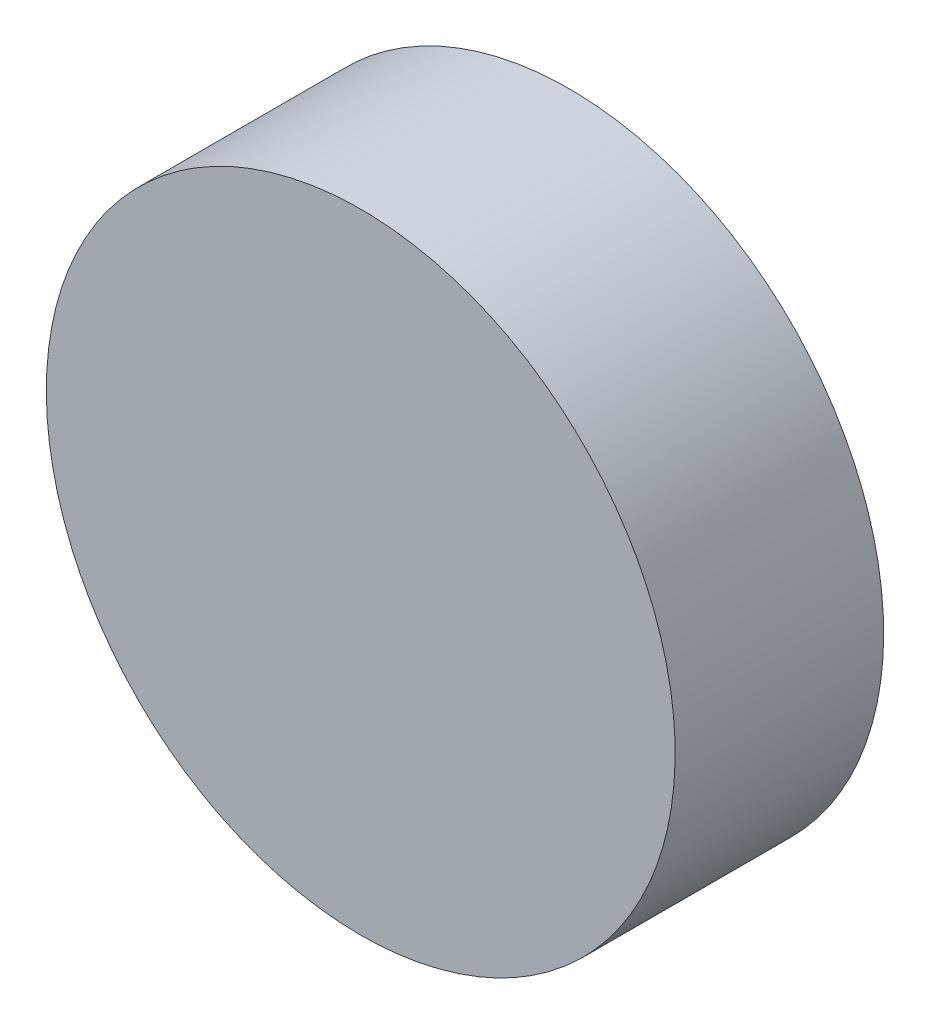
ISO-10303-21;
HEADER;
FILE_DESCRIPTION(('STEP AP214'),'2;1');
FILE_NAME('part.step','',(''),(''),'','','');
FILE_SCHEMA(('AUTOMOTIVE_DESIGN { 1 0 10303 214 1 1 1 1 }'));
ENDSEC;
DATA;
#1=APPLICATION_CONTEXT('core data for automotive mechanical design processes');
#2=APPLICATION_PROTOCOL_DEFINITION('international standard','automotive_design',2000,#1);
#3=PRODUCT_CONTEXT('',#1,'mechanical');
#4=PRODUCT('Part','Part','',(#3));
#5=PRODUCT_RELATED_PRODUCT_CATEGORY('part','',(#4));
#6=PRODUCT_DEFINITION_FORMATION('','',#4);
#7=PRODUCT_DEFINITION_CONTEXT('part definition',#1,'design');
#8=PRODUCT_DEFINITION('design','',#6,#7);
#9=PRODUCT_DEFINITION_SHAPE('','',#8);
#10=(LENGTH_UNIT() NAMED_UNIT(*) SI_UNIT(.MILLI.,.METRE.));
#11=(NAMED_UNIT(*) PLANE_ANGLE_UNIT() SI_UNIT($,.RADIAN.));
#12=(NAMED_UNIT(*) SI_UNIT($,.STERADIAN.) SOLID_ANGLE_UNIT());
#13=UNCERTAINTY_MEASURE_WITH_UNIT(LENGTH_MEASURE(1.E-05),#10,'distance_accuracy_value','');
#14=(GEOMETRIC_REPRESENTATION_CONTEXT(3) GLOBAL_UNCERTAINTY_ASSIGNED_CONTEXT((#13)) GLOBAL_UNIT_ASSIGNED_CONTEXT((#10,
#11,#12)) REPRESENTATION_CONTEXT('',''));
#15=CARTESIAN_POINT('',(0.,0.,0.));
#16=DIRECTION('',(0.,0.,1.));
#17=DIRECTION('',(1.,0.,0.));
#18=AXIS2_PLACEMENT_3D('',#15,#16,#17);
#19=CARTESIAN_POINT('',(3.01144784413701,66.8258666537316,123.808385168912));
#20=CARTESIAN_POINT('',(3.17967782334465,66.8258666537316,123.808385168912));
#21=CARTESIAN_POINT('',(3.51613778175993,66.8927927005884,123.808385168912));
#22=CARTESIAN_POINT('',(3.94399325140544,67.1786765855225,123.808385168912));
#23=CARTESIAN_POINT('',(4.2298771363395,67.606532055168,123.808385168912));
#24=CARTESIAN_POINT('',(4.33026620662476,68.1112219927909,123.808385168912));
#25=CARTESIAN_POINT('',(4.2298771363395,68.6159119304138,123.808385168912));
#26=CARTESIAN_POINT('',(3.94399325140544,69.0437674000594,123.808385168912));
#27=CARTESIAN_POINT('',(3.51613778175993,69.3296512849934,123.808385168912));
#28=CARTESIAN_POINT('',(3.01144784413701,69.4300403552787,123.808385168912));
#29=CARTESIAN_POINT('',(2.5067579065141,69.3296512849934,123.808385168912));
#30=CARTESIAN_POINT('',(2.07890243686859,69.0437674000594,123.808385168912));
#31=CARTESIAN_POINT('',(1.79301855193453,68.6159119304138,123.808385168912));
#32=CARTESIAN_POINT('',(1.69262948164926,68.1112219927909,123.808385168912));
#33=CARTESIAN_POINT('',(1.79301855193453,67.606532055168,123.808385168912));
#34=CARTESIAN_POINT('',(2.07890243686859,67.1786765855225,123.808385168912));
#35=CARTESIAN_POINT('',(2.5067579065141,66.8927927005885,123.808385168912));
#36=CARTESIAN_POINT('',(2.84321786492937,66.8258666537316,123.808385168912));
#37=CARTESIAN_POINT('',(3.01144784413701,66.8258666537316,123.808385168912));
#38=B_SPLINE_CURVE_WITH_KNOTS('',3,(#19,#20,#21,#22,#23,#24,#25,#26,#27,#28,#29,#30,#31,#32,#33,
#34,#35,#36,#37),.UNSPECIFIED.,.T.,.F.,(4,1,1,1,1,1,1,1,1,1,1,1,1,1,1,1,4),(0.,
0.0625000000000002,0.125,0.187499999999999,0.25,0.312500000000001,0.375,0.4375,0.5,0.5625,0.625,
0.687499999999999,0.75,0.812500000000001,0.875,0.9375,1.),.UNSPECIFIED.);
#39=DIRECTION('',(0.,0.,1.));
#40=VECTOR('',#39,1.);
#41=SURFACE_OF_LINEAR_EXTRUSION('',#38,#40);
#42=CARTESIAN_POINT('',(3.01144784413701,66.8258666537316,123.808385168912));
#43=CARTESIAN_POINT('',(3.17967782334465,66.8258666537316,123.808385168912));
#44=CARTESIAN_POINT('',(3.51613778175993,66.8927927005884,123.808385168912));
#45=CARTESIAN_POINT('',(3.94399325140544,67.1786765855225,123.808385168912));
#46=CARTESIAN_POINT('',(4.2298771363395,67.606532055168,123.808385168912));
#47=CARTESIAN_POINT('',(4.33026620662476,68.1112219927909,123.808385168912));
#48=CARTESIAN_POINT('',(4.2298771363395,68.6159119304138,123.808385168912));
#49=CARTESIAN_POINT('',(3.94399325140544,69.0437674000594,123.808385168912));
#50=CARTESIAN_POINT('',(3.51613778175993,69.3296512849934,123.808385168912));
#51=CARTESIAN_POINT('',(3.01144784413701,69.4300403552787,123.808385168912));
#52=CARTESIAN_POINT('',(2.5067579065141,69.3296512849934,123.808385168912));
#53=CARTESIAN_POINT('',(2.07890243686859,69.0437674000594,123.808385168912));
#54=CARTESIAN_POINT('',(1.79301855193453,68.6159119304138,123.808385168912));
#55=CARTESIAN_POINT('',(1.69262948164926,68.1112219927909,123.808385168912));
#56=CARTESIAN_POINT('',(1.79301855193453,67.606532055168,123.808385168912));
#57=CARTESIAN_POINT('',(2.07890243686859,67.1786765855225,123.808385168912));
#58=CARTESIAN_POINT('',(2.5067579065141,66.8927927005885,123.808385168912));
#59=CARTESIAN_POINT('',(2.84321786492937,66.8258666537316,123.808385168912));
#60=CARTESIAN_POINT('',(3.01144784413701,66.8258666537316,123.808385168912));
#61=B_SPLINE_CURVE_WITH_KNOTS('',3,(#42,#43,#44,#45,#46,#47,#48,#49,#50,#51,#52,#53,#54,#55,#56,
#57,#58,#59,#60),.UNSPECIFIED.,.T.,.F.,(4,1,1,1,1,1,1,1,1,1,1,1,1,1,1,1,4),(0.,
0.0625000000000002,0.125,0.187499999999999,0.25,0.312500000000001,0.375,0.4375,0.5,0.5625,0.625,
0.687499999999999,0.75,0.812500000000001,0.875,0.9375,1.),.UNSPECIFIED.);
#62=CARTESIAN_POINT('',(3.01144784413701,66.8258666537316,123.808385168912));
#63=VERTEX_POINT('',#62);
#64=EDGE_CURVE('E9',#63,#63,#61,.T.);
#65=ORIENTED_EDGE('',*,*,#64,.T.);
#66=EDGE_LOOP('',(#65));
#67=FACE_BOUND('',#66,.T.);
#68=CARTESIAN_POINT('',(3.01144784413701,66.8258666537316,124.660837467507));
#69=CARTESIAN_POINT('',(2.99041860054767,66.8258666385074,124.660837467507));
#70=CARTESIAN_POINT('',(2.96938979344613,66.8263895363258,124.660837467507));
#71=CARTESIAN_POINT('',(2.92738219718556,66.8284710407304,124.660837467507));
#72=CARTESIAN_POINT('',(2.90640341104201,66.8300297082485,124.660837467507));
#73=CARTESIAN_POINT('',(2.8645460516574,66.8341727745088,124.660837467507));
#74=CARTESIAN_POINT('',(2.84366748539274,66.8367572436396,124.660837467507));
#75=CARTESIAN_POINT('',(2.80206045823913,66.8429419710092,124.660837467507));
#76=CARTESIAN_POINT('',(2.78133200386357,66.8465422730576,124.660837467507));
#77=CARTESIAN_POINT('',(2.74007518295327,66.8547487643015,124.660837467507));
#78=CARTESIAN_POINT('',(2.71954681641853,66.859354953497,124.660837467507));
#79=CARTESIAN_POINT('',(2.67874013488497,66.8695633347226,124.660837467507));
#80=CARTESIAN_POINT('',(2.65846180913921,66.8751654837849,124.660837467507));
#81=CARTESIAN_POINT('',(2.61820520111582,66.8873558917427,124.660837467507));
#82=CARTESIAN_POINT('',(2.59822689834314,66.8939440829398,124.660837467507));
#83=CARTESIAN_POINT('',(2.55862026109262,66.9080966939716,124.660837467507));
#84=CARTESIAN_POINT('',(2.5389919060955,66.9156610563526,124.660837467507));
#85=CARTESIAN_POINT('',(2.50013539625849,66.9317559497072,124.660837467507));
#86=CARTESIAN_POINT('',(2.4809072414186,66.9402864806808,124.660837467507));
#87=CARTESIAN_POINT('',(2.44289371237703,66.9582851952663,124.660837467507));
#88=CARTESIAN_POINT('',(2.42410836429195,66.9677534340133,124.660837467507));
#89=CARTESIAN_POINT('',(2.38702272376165,66.9875992342619,124.660837467507));
#90=CARTESIAN_POINT('',(2.36872246469421,66.9979768581256,124.660837467507));
#91=CARTESIAN_POINT('',(2.33264936741224,67.0196131242883,124.660837467507));
#92=CARTESIAN_POINT('',(2.3148765519812,67.0308718045693,124.660837467507));
#93=CARTESIAN_POINT('',(2.27990071026352,67.0542419148483,124.660837467507));
#94=CARTESIAN_POINT('',(2.26269768397688,67.0663533448462,124.660837467507));
#95=CARTESIAN_POINT('',(2.22890380382521,67.0914007005008,124.660837467507));
#96=CARTESIAN_POINT('',(2.21231292358824,67.1043365905732,124.660837467507));
#97=CARTESIAN_POINT('',(2.17978573472298,67.1310045958512,124.660837467507));
#98=CARTESIAN_POINT('',(2.16384938125272,67.1447366563547,124.660837467507));
#99=CARTESIAN_POINT('',(2.13267358946463,67.1729687679224,124.660837467507));
#100=CARTESIAN_POINT('',(2.11743411020286,67.1874687737587,124.660837467507));
#101=CARTESIAN_POINT('',(2.0876946251048,67.2172082588568,124.660837467507));
#102=CARTESIAN_POINT('',(2.07319461926851,67.2324477381186,124.660837467507));
#103=CARTESIAN_POINT('',(2.04496250770079,67.2636235299066,124.660837467507));
#104=CARTESIAN_POINT('',(2.03123044719729,67.2795598833769,124.660837467507));
#105=CARTESIAN_POINT('',(2.00456244191934,67.3120870722422,124.660837467507));
#106=CARTESIAN_POINT('',(1.99162655184691,67.3286779524791,124.660837467507));
#107=CARTESIAN_POINT('',(1.96657919619227,67.3624718326308,124.660837467507));
#108=CARTESIAN_POINT('',(1.95446776619437,67.3796748589175,124.660837467507));
#109=CARTESIAN_POINT('',(1.93109765591542,67.4146507006351,124.660837467507));
#110=CARTESIAN_POINT('',(1.91983897563436,67.432423516066,124.660837467507));
#111=CARTESIAN_POINT('',(1.89820270947167,67.4684966133483,124.660837467507));
#112=CARTESIAN_POINT('',(1.88782508560801,67.4867968724161,124.660837467507));
#113=CARTESIAN_POINT('',(1.86797928535936,67.5238825129454,124.660837467507));
#114=CARTESIAN_POINT('',(1.85851104661225,67.5426678610292,124.660837467507));
#115=CARTESIAN_POINT('',(1.84051233202704,67.5806813900743,124.660837467507));
#116=CARTESIAN_POINT('',(1.83198180105371,67.5999095449191,124.660837467507));
#117=CARTESIAN_POINT('',(1.81588690769828,67.6387660547427,124.660837467507));
#118=CARTESIAN_POINT('',(1.80832254531619,67.6583944097216,124.660837467507));
#119=CARTESIAN_POINT('',(1.79416993428737,67.6980010470221,124.660837467507));
#120=CARTESIAN_POINT('',(1.78758174309437,67.717979349863,124.660837467507));
#121=CARTESIAN_POINT('',(1.77539133512531,67.7582359576999,124.660837467507));
#122=CARTESIAN_POINT('',(1.76978918604761,67.7785142831908,124.660837467507));
#123=CARTESIAN_POINT('',(1.75958080486413,67.8193209654206,124.660837467507));
#124=CARTESIAN_POINT('',(1.75497461572609,67.8398493329066,124.660837467507));
#125=CARTESIAN_POINT('',(1.74676812432518,67.8811061512181,124.660837467507));
#126=CARTESIAN_POINT('',(1.74316782206232,67.9018346020437,124.660837467507));
#127=CARTESIAN_POINT('',(1.73698309527865,67.9434416388958,124.660837467507));
#128=CARTESIAN_POINT('',(1.73439862694815,67.9643202184081,124.660837467507));
#129=CARTESIAN_POINT('',(1.73025555850135,68.0061775416004,124.660837467507));
#130=CARTESIAN_POINT('',(1.72869688799682,68.0271562783083,124.660837467507));
#131=CARTESIAN_POINT('',(1.72661539175135,68.0691640096273,124.660837467507));
#132=CARTESIAN_POINT('',(1.72609250507769,68.0901930012091,124.660837467507));
#133=CARTESIAN_POINT('',(1.72609250507769,68.1322509843728,124.660837467507));
#134=CARTESIAN_POINT('',(1.72661539175135,68.1532799759546,124.660837467507));
#135=CARTESIAN_POINT('',(1.72869688799682,68.1952877072736,124.660837467507));
#136=CARTESIAN_POINT('',(1.73025555850135,68.2162664439815,124.660837467507));
#137=CARTESIAN_POINT('',(1.73439862694815,68.2581237671738,124.660837467507));
#138=CARTESIAN_POINT('',(1.73698309527865,68.2790023466861,124.660837467507));
#139=CARTESIAN_POINT('',(1.74316782206232,68.3206093835382,124.660837467507));
#140=CARTESIAN_POINT('',(1.74676812432518,68.3413378343638,124.660837467507));
#141=CARTESIAN_POINT('',(1.75497461572609,68.3825946526753,124.660837467507));
#142=CARTESIAN_POINT('',(1.75958080486413,68.4031230201613,124.660837467507));
#143=CARTESIAN_POINT('',(1.76978918604761,68.4439297023911,124.660837467507));
#144=CARTESIAN_POINT('',(1.77539133512531,68.464208027882,124.660837467507));
#145=CARTESIAN_POINT('',(1.78758174309437,68.5044646357188,124.660837467507));
#146=CARTESIAN_POINT('',(1.79416993428737,68.5244429385598,124.660837467507));
#147=CARTESIAN_POINT('',(1.80832254531619,68.5640495758603,124.660837467507));
#148=CARTESIAN_POINT('',(1.81588690769828,68.5836779308392,124.660837467507));
#149=CARTESIAN_POINT('',(1.83198180105371,68.6225344406628,124.660837467507));
#150=CARTESIAN_POINT('',(1.84051233202704,68.6417625955076,124.660837467507));
#151=CARTESIAN_POINT('',(1.85851104661225,68.6797761245527,124.660837467507));
#152=CARTESIAN_POINT('',(1.86797928535936,68.6985614726365,124.660837467507));
#153=CARTESIAN_POINT('',(1.88782508560801,68.7356471131658,124.660837467507));
#154=CARTESIAN_POINT('',(1.89820270947167,68.7539473722336,124.660837467507));
#155=CARTESIAN_POINT('',(1.91983897563436,68.7900204695158,124.660837467507));
#156=CARTESIAN_POINT('',(1.93109765591542,68.8077932849468,124.660837467507));
#157=CARTESIAN_POINT('',(1.95446776619437,68.8427691266644,124.660837467507));
#158=CARTESIAN_POINT('',(1.96657919619226,68.8599721529511,124.660837467507));
#159=CARTESIAN_POINT('',(1.99162655184691,68.8937660331028,124.660837467507));
#160=CARTESIAN_POINT('',(2.00456244191935,68.9103569133397,124.660837467507));
#161=CARTESIAN_POINT('',(2.0312304471973,68.942884102205,124.660837467507));
#162=CARTESIAN_POINT('',(2.04496250770079,68.9588204556752,124.660837467507));
#163=CARTESIAN_POINT('',(2.07319461926851,68.9899962474633,124.660837467507));
#164=CARTESIAN_POINT('',(2.0876946251048,69.0052357267251,124.660837467507));
#165=CARTESIAN_POINT('',(2.11743411020286,69.0349752118231,124.660837467507));
#166=CARTESIAN_POINT('',(2.13267358946462,69.0494752176594,124.660837467507));
#167=CARTESIAN_POINT('',(2.16384938125272,69.0777073292272,124.660837467507));
#168=CARTESIAN_POINT('',(2.17978573472298,69.0914393897307,124.660837467507));
#169=CARTESIAN_POINT('',(2.21231292358824,69.1181073950086,124.660837467507));
#170=CARTESIAN_POINT('',(2.2289038038252,69.131043285081,124.660837467507));
#171=CARTESIAN_POINT('',(2.26269768397689,69.1560906407357,124.660837467507));
#172=CARTESIAN_POINT('',(2.27990071026356,69.1682020707336,124.660837467507));
#173=CARTESIAN_POINT('',(2.31487655198117,69.1915721810125,124.660837467507));
#174=CARTESIAN_POINT('',(2.33264936741211,69.2028308612936,124.660837467507));
#175=CARTESIAN_POINT('',(2.36872246469434,69.2244671274563,124.660837467507));
#176=CARTESIAN_POINT('',(2.38702272376213,69.2348447513199,124.660837467507));
#177=CARTESIAN_POINT('',(2.42410836429147,69.2546905515686,124.660837467507));
#178=CARTESIAN_POINT('',(2.44289371237524,69.2641587903157,124.660837467507));
#179=CARTESIAN_POINT('',(2.4809072414204,69.2821575049009,124.660837467507));
#180=CARTESIAN_POINT('',(2.50013539626519,69.2906880358742,124.660837467507));
#181=CARTESIAN_POINT('',(2.53899190608881,69.3067829292297,124.660837467507));
#182=CARTESIAN_POINT('',(2.55862026106763,69.3143472916118,124.660837467507));
#183=CARTESIAN_POINT('',(2.59822689836813,69.3284999026406,124.660837467507));
#184=CARTESIAN_POINT('',(2.6182052012091,69.3350880938336,124.660837467507));
#185=CARTESIAN_POINT('',(2.65846180904593,69.3472785018026,124.660837467507));
#186=CARTESIAN_POINT('',(2.67874013453683,69.3528806508803,124.660837467507));
#187=CARTESIAN_POINT('',(2.71954681676669,69.3630890320638,124.660837467507));
#188=CARTESIAN_POINT('',(2.74007518425264,69.3676952212019,124.660837467507));
#189=CARTESIAN_POINT('',(2.7813320025642,69.3759017126028,124.660837467507));
#190=CARTESIAN_POINT('',(2.8020604533898,69.3795020148656,124.660837467507));
#191=CARTESIAN_POINT('',(2.84366749024185,69.3856867416493,124.660837467507));
#192=CARTESIAN_POINT('',(2.86454606975417,69.3882712099798,124.660837467507));
#193=CARTESIAN_POINT('',(2.90640339294648,69.3924142784266,124.660837467507));
#194=CARTESIAN_POINT('',(2.92738212965438,69.3939729489311,124.660837467507));
#195=CARTESIAN_POINT('',(2.96938986097335,69.3960544451766,124.660837467507));
#196=CARTESIAN_POINT('',(2.99041885255518,69.3965773318503,124.660837467507));
#197=CARTESIAN_POINT('',(3.03247683571885,69.3965773318503,124.660837467507));
#198=CARTESIAN_POINT('',(3.05350582730068,69.3960544451766,124.660837467507));
#199=CARTESIAN_POINT('',(3.09551355861965,69.3939729489311,124.660837467507));
#200=CARTESIAN_POINT('',(3.11649229532754,69.3924142784266,124.660837467507));
#201=CARTESIAN_POINT('',(3.15834961851986,69.3882712099798,124.660837467507));
#202=CARTESIAN_POINT('',(3.17922819803217,69.3856867416493,124.660837467507));
#203=CARTESIAN_POINT('',(3.22083523488422,69.3795020148656,124.660837467507));
#204=CARTESIAN_POINT('',(3.24156368570983,69.3759017126028,124.660837467507));
#205=CARTESIAN_POINT('',(3.28282050402139,69.3676952212019,124.660837467507));
#206=CARTESIAN_POINT('',(3.30334887150734,69.3630890320638,124.660837467507));
#207=CARTESIAN_POINT('',(3.3441555537372,69.3528806508803,124.660837467507));
#208=CARTESIAN_POINT('',(3.36443387922809,69.3472785018026,124.660837467507));
#209=CARTESIAN_POINT('',(3.40469048706493,69.3350880938336,124.660837467507));
#210=CARTESIAN_POINT('',(3.4246687899059,69.3284999026406,124.660837467507));
#211=CARTESIAN_POINT('',(3.4642754272064,69.3143472916118,124.660837467507));
#212=CARTESIAN_POINT('',(3.48390378218522,69.3067829292297,124.660837467507));
#213=CARTESIAN_POINT('',(3.52276029200884,69.2906880358742,124.660837467507));
#214=CARTESIAN_POINT('',(3.54198844685363,69.2821575049009,124.660837467507));
#215=CARTESIAN_POINT('',(3.58000197589879,69.2641587903157,124.660837467507));
#216=CARTESIAN_POINT('',(3.59878732398256,69.2546905515686,124.660837467507));
#217=CARTESIAN_POINT('',(3.63587296451191,69.2348447513199,124.660837467507));
#218=CARTESIAN_POINT('',(3.65417322357968,69.2244671274563,124.660837467507));
#219=CARTESIAN_POINT('',(3.69024632086192,69.2028308612936,124.660837467507));
#220=CARTESIAN_POINT('',(3.70801913629286,69.1915721810125,124.660837467507));
#221=CARTESIAN_POINT('',(3.74299497801047,69.1682020707336,124.660837467507));
#222=CARTESIAN_POINT('',(3.76019800429714,69.1560906407357,124.660837467507));
#223=CARTESIAN_POINT('',(3.79399188444882,69.131043285081,124.660837467507));
#224=CARTESIAN_POINT('',(3.81058276468579,69.1181073950086,124.660837467507));
#225=CARTESIAN_POINT('',(3.84310995355105,69.0914393897306,124.660837467507));
#226=CARTESIAN_POINT('',(3.85904630702131,69.0777073292272,124.660837467507));
#227=CARTESIAN_POINT('',(3.8902220988094,69.0494752176594,124.660837467507));
#228=CARTESIAN_POINT('',(3.90546157807117,69.0349752118231,124.660837467507));
#229=CARTESIAN_POINT('',(3.93520106316923,69.0052357267251,124.660837467507));
#230=CARTESIAN_POINT('',(3.94970106900552,68.9899962474633,124.660837467507));
#231=CARTESIAN_POINT('',(3.97793318057324,68.9588204556752,124.660837467507));
#232=CARTESIAN_POINT('',(3.99166524107673,68.942884102205,124.660837467507));
#233=CARTESIAN_POINT('',(4.01833324635468,68.9103569133397,124.660837467507));
#234=CARTESIAN_POINT('',(4.03126913642712,68.8937660331027,124.660837467507));
#235=CARTESIAN_POINT('',(4.05631649208176,68.8599721529511,124.660837467507));
#236=CARTESIAN_POINT('',(4.06842792207966,68.8427691266644,124.660837467507));
#237=CARTESIAN_POINT('',(4.09179803235861,68.8077932849468,124.660837467507));
#238=CARTESIAN_POINT('',(4.10305671263967,68.7900204695159,124.660837467507));
#239=CARTESIAN_POINT('',(4.12469297880236,68.7539473722336,124.660837467507));
#240=CARTESIAN_POINT('',(4.13507060266602,68.7356471131658,124.660837467507));
#241=CARTESIAN_POINT('',(4.15491640291466,68.6985614726365,124.660837467507));
#242=CARTESIAN_POINT('',(4.16438464166178,68.6797761245527,124.660837467507));
#243=CARTESIAN_POINT('',(4.18238335624699,68.6417625955076,124.660837467507));
#244=CARTESIAN_POINT('',(4.19091388722032,68.6225344406628,124.660837467507));
#245=CARTESIAN_POINT('',(4.20700878057574,68.5836779308391,124.660837467507));
#246=CARTESIAN_POINT('',(4.21457314295784,68.5640495758603,124.660837467507));
#247=CARTESIAN_POINT('',(4.22872575398666,68.5244429385598,124.660837467507));
#248=CARTESIAN_POINT('',(4.23531394517966,68.5044646357188,124.660837467507));
#249=CARTESIAN_POINT('',(4.24750435314872,68.464208027882,124.660837467507));
#250=CARTESIAN_POINT('',(4.25310650222642,68.4439297023911,124.660837467507));
#251=CARTESIAN_POINT('',(4.2633148834099,68.4031230201613,124.660837467507));
#252=CARTESIAN_POINT('',(4.26792107254794,68.3825946526753,124.660837467507));
#253=CARTESIAN_POINT('',(4.27612756394885,68.3413378343638,124.660837467507));
#254=CARTESIAN_POINT('',(4.27972786621171,68.3206093835382,124.660837467507));
#255=CARTESIAN_POINT('',(4.28591259299537,68.2790023466861,124.660837467507));
#256=CARTESIAN_POINT('',(4.28849706132588,68.2581237671738,124.660837467507));
#257=CARTESIAN_POINT('',(4.29264012977268,68.2162664439815,124.660837467507));
#258=CARTESIAN_POINT('',(4.2941988002772,68.1952877072736,124.660837467507));
#259=CARTESIAN_POINT('',(4.29628029652268,68.1532799759546,124.660837467507));
#260=CARTESIAN_POINT('',(4.29680318319634,68.1322509843728,124.660837467507));
#261=CARTESIAN_POINT('',(4.29680318319634,68.0901930012091,124.660837467507));
#262=CARTESIAN_POINT('',(4.29628029652268,68.0691640096273,124.660837467507));
#263=CARTESIAN_POINT('',(4.2941988002772,68.0271562783083,124.660837467507));
#264=CARTESIAN_POINT('',(4.29264012977268,68.0061775416004,124.660837467507));
#265=CARTESIAN_POINT('',(4.28849706132588,67.9643202184081,124.660837467507));
#266=CARTESIAN_POINT('',(4.28591259299537,67.9434416388958,124.660837467507));
#267=CARTESIAN_POINT('',(4.27972786621171,67.9018346020437,124.660837467507));
#268=CARTESIAN_POINT('',(4.27612756394885,67.8811061512181,124.660837467507));
#269=CARTESIAN_POINT('',(4.26792107254794,67.8398493329066,124.660837467507));
#270=CARTESIAN_POINT('',(4.2633148834099,67.8193209654206,124.660837467507));
#271=CARTESIAN_POINT('',(4.25310650222642,67.7785142831908,124.660837467507));
#272=CARTESIAN_POINT('',(4.24750435314872,67.7582359576999,124.660837467507));
#273=CARTESIAN_POINT('',(4.23531394517966,67.717979349863,124.660837467507));
#274=CARTESIAN_POINT('',(4.22872575398666,67.6980010470221,124.660837467507));
#275=CARTESIAN_POINT('',(4.21457314295784,67.6583944097216,124.660837467507));
#276=CARTESIAN_POINT('',(4.20700878057575,67.6387660547427,124.660837467507));
#277=CARTESIAN_POINT('',(4.19091388722032,67.5999095449191,124.660837467507));
#278=CARTESIAN_POINT('',(4.18238335624699,67.5806813900743,124.660837467507));
#279=CARTESIAN_POINT('',(4.16438464166178,67.5426678610292,124.660837467507));
#280=CARTESIAN_POINT('',(4.15491640291466,67.5238825129454,124.660837467507));
#281=CARTESIAN_POINT('',(4.13507060266602,67.4867968724161,124.660837467507));
#282=CARTESIAN_POINT('',(4.12469297880236,67.4684966133483,124.660837467507));
#283=CARTESIAN_POINT('',(4.10305671263967,67.432423516066,124.660837467507));
#284=CARTESIAN_POINT('',(4.09179803235861,67.4146507006351,124.660837467507));
#285=CARTESIAN_POINT('',(4.06842792207966,67.3796748589175,124.660837467507));
#286=CARTESIAN_POINT('',(4.05631649208176,67.3624718326308,124.660837467507));
#287=CARTESIAN_POINT('',(4.03126913642712,67.3286779524791,124.660837467507));
#288=CARTESIAN_POINT('',(4.01833324635469,67.3120870722422,124.660837467507));
#289=CARTESIAN_POINT('',(3.99166524107673,67.2795598833769,124.660837467507));
#290=CARTESIAN_POINT('',(3.97793318057324,67.2636235299066,124.660837467507));
#291=CARTESIAN_POINT('',(3.94970106900552,67.2324477381186,124.660837467507));
#292=CARTESIAN_POINT('',(3.93520106316923,67.2172082588568,124.660837467507));
#293=CARTESIAN_POINT('',(3.90546157807117,67.1874687737587,124.660837467507));
#294=CARTESIAN_POINT('',(3.8902220988094,67.1729687679224,124.660837467507));
#295=CARTESIAN_POINT('',(3.85904630702131,67.1447366563547,124.660837467507));
#296=CARTESIAN_POINT('',(3.84310995355105,67.1310045958512,124.660837467507));
#297=CARTESIAN_POINT('',(3.81058276468578,67.1043365905733,124.660837467507));
#298=CARTESIAN_POINT('',(3.79399188444882,67.0914007005008,124.660837467507));
#299=CARTESIAN_POINT('',(3.76019800429715,67.0663533448462,124.660837467507));
#300=CARTESIAN_POINT('',(3.74299497801051,67.0542419148483,124.660837467507));
#301=CARTESIAN_POINT('',(3.70801913629283,67.0308718045693,124.660837467507));
#302=CARTESIAN_POINT('',(3.69024632086179,67.0196131242883,124.660837467507));
#303=CARTESIAN_POINT('',(3.65417322357981,66.9979768581256,124.660837467507));
#304=CARTESIAN_POINT('',(3.63587296451238,66.9875992342619,124.660837467507));
#305=CARTESIAN_POINT('',(3.59878732398207,66.9677534340133,124.660837467507));
#306=CARTESIAN_POINT('',(3.58000197589699,66.9582851952663,124.660837467507));
#307=CARTESIAN_POINT('',(3.54198844685543,66.9402864806808,124.660837467507));
#308=CARTESIAN_POINT('',(3.52276029201553,66.9317559497072,124.660837467507));
#309=CARTESIAN_POINT('',(3.48390378217853,66.9156610563526,124.660837467507));
#310=CARTESIAN_POINT('',(3.46427542718141,66.9080966939716,124.660837467507));
#311=CARTESIAN_POINT('',(3.42466878993089,66.8939440829398,124.660837467507));
#312=CARTESIAN_POINT('',(3.40469048715821,66.8873558917426,124.660837467507));
#313=CARTESIAN_POINT('',(3.36443387913481,66.8751654837849,124.660837467507));
#314=CARTESIAN_POINT('',(3.34415555338906,66.8695633347226,124.660837467507));
#315=CARTESIAN_POINT('',(3.30334887185549,66.859354953497,124.660837467507));
#316=CARTESIAN_POINT('',(3.28282050532076,66.8547487643015,124.660837467507));
#317=CARTESIAN_POINT('',(3.24156368441046,66.8465422730576,124.660837467507));
#318=CARTESIAN_POINT('',(3.2208352300349,66.8429419710092,124.660837467507));
#319=CARTESIAN_POINT('',(3.17922820288129,66.8367572436396,124.660837467507));
#320=CARTESIAN_POINT('',(3.15834963661663,66.8341727745088,124.660837467507));
#321=CARTESIAN_POINT('',(3.11649227723201,66.8300297082484,124.660837467507));
#322=CARTESIAN_POINT('',(3.09551349108846,66.8284710407304,124.660837467507));
#323=CARTESIAN_POINT('',(3.05350589482789,66.8263895363258,124.660837467507));
#324=CARTESIAN_POINT('',(3.03247708772636,66.8258666385074,124.660837467507));
#325=CARTESIAN_POINT('',(3.01144784413701,66.8258666537316,124.660837467507));
#326=B_SPLINE_CURVE_WITH_KNOTS('',3,(#68,#69,#70,#71,#72,#73,#74,#75,#76,#77,#78,#79,#80,#81,
#82,#83,#84,#85,#86,#87,#88,#89,#90,#91,#92,#93,#94,#95,#96,#97,#98,#99,#100,#101,#102,#103,
#104,#105,#106,#107,#108,#109,#110,#111,#112,#113,#114,#115,#116,#117,#118,#119,#120,#121,#122,
#123,#124,#125,#126,#127,#128,#129,#130,#131,#132,#133,#134,#135,#136,#137,#138,#139,#140,#141,
#142,#143,#144,#145,#146,#147,#148,#149,#150,#151,#152,#153,#154,#155,#156,#157,#158,#159,#160,
#161,#162,#163,#164,#165,#166,#167,#168,#169,#170,#171,#172,#173,#174,#175,#176,#177,#178,#179,
#180,#181,#182,#183,#184,#185,#186,#187,#188,#189,#190,#191,#192,#193,#194,#195,#196,#197,#198,
#199,#200,#201,#202,#203,#204,#205,#206,#207,#208,#209,#210,#211,#212,#213,#214,#215,#216,#217,
#218,#219,#220,#221,#222,#223,#224,#225,#226,#227,#228,#229,#230,#231,#232,#233,#234,#235,#236,
#237,#238,#239,#240,#241,#242,#243,#244,#245,#246,#247,#248,#249,#250,#251,#252,#253,#254,#255,
#256,#257,#258,#259,#260,#261,#262,#263,#264,#265,#266,#267,#268,#269,#270,#271,#272,#273,#274,
#275,#276,#277,#278,#279,#280,#281,#282,#283,#284,#285,#286,#287,#288,#289,#290,#291,#292,#293,
#294,#295,#296,#297,#298,#299,#300,#301,#302,#303,#304,#305,#306,#307,#308,#309,#310,#311,#312,
#313,#314,#315,#316,#317,#318,#319,#320,#321,#322,#323,#324,#325),.UNSPECIFIED.,.F.,.F.,(4,2,2,
2,2,2,2,2,2,2,2,2,2,2,2,2,2,2,2,2,2,2,2,2,2,2,2,2,2,2,2,2,2,2,2,2,2,2,2,2,2,2,2,2,2,2,2,2,2,2,2,
2,2,2,2,2,2,2,2,2,2,2,2,2,2,2,2,2,2,2,2,2,2,2,2,2,2,2,2,2,2,2,2,2,2,2,2,2,2,2,2,2,2,2,2,2,2,2,2,
2,2,2,2,2,2,2,2,2,2,2,2,2,2,2,2,2,2,2,2,2,2,2,2,2,2,2,2,2,4),(0.,0.0630806127990786,
0.126164936809589,0.189253590290847,0.252344965001653,0.315436339712459,0.378524993193721,
0.441609317204229,0.504689930003309,0.567770542802384,0.630854866812901,0.693943520294154,
0.757034895004965,0.820126269715762,0.883214923197015,0.94629924720754,1.00937986000662,
1.0724604728057,1.1355447968162,1.19863345029747,1.26172482500828,1.3248161997191,
1.38790485320035,1.45098917721087,1.51406979000994,1.57715040280903,1.64023472681952,
1.70332338030079,1.7664147550116,1.8295061297224,1.89259478320367,1.95567910721417,
2.01875972001325,2.08184033281233,2.14492465682283,2.2080133103041,2.27110468501489,
2.33419605972571,2.39728471320695,2.46036903721747,2.52344965001655,2.58653026281562,
2.64961458682613,2.71270324030739,2.7757946150182,2.83888598972901,2.90197464321027,
2.96505896722078,3.02813958001986,3.09122019281893,3.15430451682945,3.21739317031071,
3.28048454502151,3.34357591973233,3.40666457321357,3.46974889722408,3.53282951002316,
3.59591012282224,3.65899444683275,3.72208310031401,3.78517447502482,3.84826584973563,
3.91135450321688,3.97443882722739,4.03751944002647,4.10060005282555,4.16368437683606,
4.22677303031732,4.28986440502813,4.35295577973894,4.41604443322019,4.4791287572307,
4.54220937002978,4.60528998282886,4.66837430683937,4.73146296032063,4.79455433503144,
4.85764570974225,4.9207343632235,4.98381868723401,5.04689930003309,5.10997991283216,
5.17306423684267,5.23615289032395,5.29924426503473,5.36233563974555,5.42542429322681,
5.48850861723732,5.55158923003641,5.61466984283549,5.67775416684599,5.74084282032725,
5.80393419503805,5.86702556974885,5.93011422323012,5.99319854724063,6.05627916003971,
6.11935977283879,6.18244409684929,6.24553275033054,6.30862412504137,6.37171549975216,
6.43480415323341,6.49788847724392,6.56096909004301,6.62404970284207,6.68713402685259,
6.75022268033386,6.81331405504467,6.87640542975547,6.93949408323674,7.00257840724724,
7.06565902004633,7.12873963284541,7.19182395685592,7.25491261033718,7.31800398504799,
7.38109535975879,7.44418401324005,7.50726833725057,7.57034895004965,7.63342956284872,
7.69651388685923,7.75960254034049,7.82269391505129,7.8857852897621,7.94887394324336,
8.01195826725387,8.07503888005295),.UNSPECIFIED.);
#327=CARTESIAN_POINT('',(3.01144784413701,66.8258666537316,124.660837467507));
#328=VERTEX_POINT('',#327);
#329=EDGE_CURVE('E24',#328,#328,#326,.F.);
#330=ORIENTED_EDGE('',*,*,#329,.F.);
#331=EDGE_LOOP('',(#330));
#332=FACE_BOUND('',#331,.T.);
#333=ADVANCED_FACE('F14',(#67,#332),#41,.T.);
#334=CARTESIAN_POINT('',(16.761447844137,68.1112219927909,123.808385168912));
#335=DIRECTION('',(0.,0.,1.));
#336=DIRECTION('',(0.,-1.,0.));
#337=AXIS2_PLACEMENT_3D('',#334,#335,#336);
#338=PLANE('',#337);
#339=ORIENTED_EDGE('',*,*,#64,.F.);
#340=EDGE_LOOP('',(#339));
#341=FACE_BOUND('',#340,.T.);
#342=ADVANCED_FACE('F62',(#341),#338,.F.);
#343=CARTESIAN_POINT('',(16.761447844137,68.1112219927909,124.660837467507));
#344=DIRECTION('',(0.,0.,1.));
#345=DIRECTION('',(0.,-1.,0.));
#346=AXIS2_PLACEMENT_3D('',#343,#344,#345);
#347=PLANE('',#346);
#348=ORIENTED_EDGE('',*,*,#329,.T.);
#349=EDGE_LOOP('',(#348));
#350=FACE_BOUND('',#349,.T.);
#351=ADVANCED_FACE('F31',(#350),#347,.T.);
#352=CLOSED_SHELL('',(#333,#342,#351));
#353=MANIFOLD_SOLID_BREP('B1',#352);
#354=ADVANCED_BREP_SHAPE_REPRESENTATION('',(#18,#353),#14);
#355=SHAPE_DEFINITION_REPRESENTATION(#9,#354);
ENDSEC;
END-ISO-10303-21;
